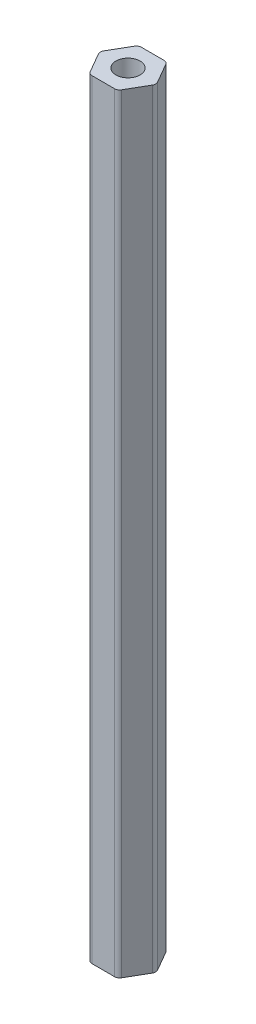
ISO-10303-21;
HEADER;
FILE_DESCRIPTION(('STEP AP214'),'2;1');
FILE_NAME('part.step','',(''),(''),'','','');
FILE_SCHEMA(('AUTOMOTIVE_DESIGN { 1 0 10303 214 1 1 1 1 }'));
ENDSEC;
DATA;
#1=APPLICATION_CONTEXT('core data for automotive mechanical design processes');
#2=APPLICATION_PROTOCOL_DEFINITION('international standard','automotive_design',2000,#1);
#3=PRODUCT_CONTEXT('',#1,'mechanical');
#4=PRODUCT('Part','Part','',(#3));
#5=PRODUCT_RELATED_PRODUCT_CATEGORY('part','',(#4));
#6=PRODUCT_DEFINITION_FORMATION('','',#4);
#7=PRODUCT_DEFINITION_CONTEXT('part definition',#1,'design');
#8=PRODUCT_DEFINITION('design','',#6,#7);
#9=PRODUCT_DEFINITION_SHAPE('','',#8);
#10=(LENGTH_UNIT() NAMED_UNIT(*) SI_UNIT(.MILLI.,.METRE.));
#11=(NAMED_UNIT(*) PLANE_ANGLE_UNIT() SI_UNIT($,.RADIAN.));
#12=(NAMED_UNIT(*) SI_UNIT($,.STERADIAN.) SOLID_ANGLE_UNIT());
#13=UNCERTAINTY_MEASURE_WITH_UNIT(LENGTH_MEASURE(1.E-05),#10,'distance_accuracy_value','');
#14=(GEOMETRIC_REPRESENTATION_CONTEXT(3) GLOBAL_UNCERTAINTY_ASSIGNED_CONTEXT((#13)) GLOBAL_UNIT_ASSIGNED_CONTEXT((#10,
#11,#12)) REPRESENTATION_CONTEXT('',''));
#15=CARTESIAN_POINT('',(0.,0.,0.));
#16=DIRECTION('',(0.,0.,1.));
#17=DIRECTION('',(1.,0.,0.));
#18=AXIS2_PLACEMENT_3D('',#15,#16,#17);
#19=CARTESIAN_POINT('',(-2.88675134594813,80.,0.));
#20=DIRECTION('',(0.866025403784439,0.,-0.5));
#21=DIRECTION('',(0.,-1.,0.));
#22=AXIS2_PLACEMENT_3D('',#19,#20,#21);
#23=PLANE('',#22);
#24=DIRECTION('',(0.5,0.,0.866025403784439));
#25=VECTOR('',#24,1.);
#26=CARTESIAN_POINT('',(-2.88675134594813,0.,0.));
#27=LINE('',#26,#25);
#28=CARTESIAN_POINT('',(-2.74241377865073,0.,0.25));
#29=VERTEX_POINT('',#28);
#30=CARTESIAN_POINT('',(-1.58771324027147,0.,2.25));
#31=VERTEX_POINT('',#30);
#32=EDGE_CURVE('E12',#29,#31,#27,.T.);
#33=ORIENTED_EDGE('',*,*,#32,.T.);
#34=DIRECTION('',(0.,1.,0.));
#35=VECTOR('',#34,1.);
#36=CARTESIAN_POINT('',(-1.58771324027147,80.,2.25));
#37=LINE('',#36,#35);
#38=CARTESIAN_POINT('',(-1.58771324027147,78.,2.25));
#39=VERTEX_POINT('',#38);
#40=EDGE_CURVE('E50',#31,#39,#37,.T.);
#41=ORIENTED_EDGE('',*,*,#40,.T.);
#42=DIRECTION('',(0.5,0.,0.866025403784439));
#43=VECTOR('',#42,1.);
#44=CARTESIAN_POINT('',(-2.88675134594813,78.,0.));
#45=LINE('',#44,#43);
#46=CARTESIAN_POINT('',(-2.74241377865073,78.,0.25));
#47=VERTEX_POINT('',#46);
#48=EDGE_CURVE('E193',#47,#39,#45,.T.);
#49=ORIENTED_EDGE('',*,*,#48,.F.);
#50=DIRECTION('',(0.,-1.,0.));
#51=VECTOR('',#50,1.);
#52=CARTESIAN_POINT('',(-2.74241377865073,80.,0.25));
#53=LINE('',#52,#51);
#54=EDGE_CURVE('E224',#47,#29,#53,.T.);
#55=ORIENTED_EDGE('',*,*,#54,.T.);
#56=EDGE_LOOP('',(#33,#41,#49,#55));
#57=FACE_BOUND('',#56,.T.);
#58=ADVANCED_FACE('F39',(#57),#23,.F.);
#59=CARTESIAN_POINT('',(-1.44337567297407,80.,2.5));
#60=DIRECTION('',(0.,0.,-1.));
#61=DIRECTION('',(0.,-1.,0.));
#62=AXIS2_PLACEMENT_3D('',#59,#60,#61);
#63=PLANE('',#62);
#64=DIRECTION('',(1.,0.,0.));
#65=VECTOR('',#64,1.);
#66=CARTESIAN_POINT('',(-1.44337567297407,78.,2.5));
#67=LINE('',#66,#65);
#68=CARTESIAN_POINT('',(-1.15470053837925,78.,2.5));
#69=VERTEX_POINT('',#68);
#70=CARTESIAN_POINT('',(1.15470053837925,78.,2.5));
#71=VERTEX_POINT('',#70);
#72=EDGE_CURVE('E111',#69,#71,#67,.T.);
#73=ORIENTED_EDGE('',*,*,#72,.F.);
#74=DIRECTION('',(0.,-1.,0.));
#75=VECTOR('',#74,1.);
#76=CARTESIAN_POINT('',(-1.15470053837925,80.,2.5));
#77=LINE('',#76,#75);
#78=CARTESIAN_POINT('',(-1.15470053837925,0.,2.5));
#79=VERTEX_POINT('',#78);
#80=EDGE_CURVE('E222',#69,#79,#77,.T.);
#81=ORIENTED_EDGE('',*,*,#80,.T.);
#82=DIRECTION('',(1.,0.,0.));
#83=VECTOR('',#82,1.);
#84=CARTESIAN_POINT('',(-1.44337567297407,0.,2.5));
#85=LINE('',#84,#83);
#86=CARTESIAN_POINT('',(1.15470053837925,0.,2.5));
#87=VERTEX_POINT('',#86);
#88=EDGE_CURVE('E120',#79,#87,#85,.T.);
#89=ORIENTED_EDGE('',*,*,#88,.T.);
#90=DIRECTION('',(0.,1.,0.));
#91=VECTOR('',#90,1.);
#92=CARTESIAN_POINT('',(1.15470053837925,80.,2.5));
#93=LINE('',#92,#91);
#94=EDGE_CURVE('E177',#87,#71,#93,.T.);
#95=ORIENTED_EDGE('',*,*,#94,.T.);
#96=EDGE_LOOP('',(#73,#81,#89,#95));
#97=FACE_BOUND('',#96,.T.);
#98=ADVANCED_FACE('F285',(#97),#63,.F.);
#99=CARTESIAN_POINT('',(1.44337567297407,80.,2.5));
#100=DIRECTION('',(-0.866025403784439,0.,-0.5));
#101=DIRECTION('',(-0.5,0.,0.866025403784439));
#102=AXIS2_PLACEMENT_3D('',#99,#100,#101);
#103=PLANE('',#102);
#104=DIRECTION('',(0.5,0.,-0.866025403784439));
#105=VECTOR('',#104,1.);
#106=CARTESIAN_POINT('',(1.44337567297407,0.,2.5));
#107=LINE('',#106,#105);
#108=CARTESIAN_POINT('',(1.58771324027147,0.,2.25));
#109=VERTEX_POINT('',#108);
#110=CARTESIAN_POINT('',(2.74241377865073,0.,0.25));
#111=VERTEX_POINT('',#110);
#112=EDGE_CURVE('E187',#109,#111,#107,.T.);
#113=ORIENTED_EDGE('',*,*,#112,.T.);
#114=DIRECTION('',(0.,1.,0.));
#115=VECTOR('',#114,1.);
#116=CARTESIAN_POINT('',(2.74241377865073,80.,0.25));
#117=LINE('',#116,#115);
#118=CARTESIAN_POINT('',(2.74241377865073,78.,0.25));
#119=VERTEX_POINT('',#118);
#120=EDGE_CURVE('E184',#111,#119,#117,.T.);
#121=ORIENTED_EDGE('',*,*,#120,.T.);
#122=DIRECTION('',(0.5,0.,-0.866025403784439));
#123=VECTOR('',#122,1.);
#124=CARTESIAN_POINT('',(1.44337567297407,78.,2.5));
#125=LINE('',#124,#123);
#126=CARTESIAN_POINT('',(1.58771324027147,78.,2.25));
#127=VERTEX_POINT('',#126);
#128=EDGE_CURVE('E215',#127,#119,#125,.T.);
#129=ORIENTED_EDGE('',*,*,#128,.F.);
#130=DIRECTION('',(0.,-1.,0.));
#131=VECTOR('',#130,1.);
#132=CARTESIAN_POINT('',(1.58771324027147,80.,2.25));
#133=LINE('',#132,#131);
#134=EDGE_CURVE('E182',#127,#109,#133,.T.);
#135=ORIENTED_EDGE('',*,*,#134,.T.);
#136=EDGE_LOOP('',(#113,#121,#129,#135));
#137=FACE_BOUND('',#136,.T.);
#138=ADVANCED_FACE('F287',(#137),#103,.F.);
#139=CARTESIAN_POINT('',(2.88675134594813,80.,0.));
#140=DIRECTION('',(-0.866025403784438,0.,0.5));
#141=DIRECTION('',(0.,1.,0.));
#142=AXIS2_PLACEMENT_3D('',#139,#140,#141);
#143=PLANE('',#142);
#144=DIRECTION('',(-0.5,0.,-0.866025403784438));
#145=VECTOR('',#144,1.);
#146=CARTESIAN_POINT('',(2.88675134594813,78.,0.));
#147=LINE('',#146,#145);
#148=CARTESIAN_POINT('',(2.74241377865073,78.,-0.25));
#149=VERTEX_POINT('',#148);
#150=CARTESIAN_POINT('',(1.58771324027147,78.,-2.25));
#151=VERTEX_POINT('',#150);
#152=EDGE_CURVE('E210',#149,#151,#147,.T.);
#153=ORIENTED_EDGE('',*,*,#152,.F.);
#154=DIRECTION('',(0.,-1.,0.));
#155=VECTOR('',#154,1.);
#156=CARTESIAN_POINT('',(2.74241377865073,80.,-0.25));
#157=LINE('',#156,#155);
#158=CARTESIAN_POINT('',(2.74241377865073,0.,-0.25));
#159=VERTEX_POINT('',#158);
#160=EDGE_CURVE('E178',#149,#159,#157,.T.);
#161=ORIENTED_EDGE('',*,*,#160,.T.);
#162=DIRECTION('',(-0.5,0.,-0.866025403784438));
#163=VECTOR('',#162,1.);
#164=CARTESIAN_POINT('',(2.88675134594813,0.,0.));
#165=LINE('',#164,#163);
#166=CARTESIAN_POINT('',(1.58771324027147,0.,-2.25));
#167=VERTEX_POINT('',#166);
#168=EDGE_CURVE('E183',#159,#167,#165,.T.);
#169=ORIENTED_EDGE('',*,*,#168,.T.);
#170=DIRECTION('',(0.,1.,0.));
#171=VECTOR('',#170,1.);
#172=CARTESIAN_POINT('',(1.58771324027147,80.,-2.25));
#173=LINE('',#172,#171);
#174=EDGE_CURVE('E249',#167,#151,#173,.T.);
#175=ORIENTED_EDGE('',*,*,#174,.T.);
#176=EDGE_LOOP('',(#153,#161,#169,#175));
#177=FACE_BOUND('',#176,.T.);
#178=ADVANCED_FACE('F268',(#177),#143,.F.);
#179=CARTESIAN_POINT('',(1.44337567297407,80.,-2.5));
#180=DIRECTION('',(0.,0.,1.));
#181=DIRECTION('',(1.,0.,0.));
#182=AXIS2_PLACEMENT_3D('',#179,#180,#181);
#183=PLANE('',#182);
#184=DIRECTION('',(-1.,0.,0.));
#185=VECTOR('',#184,1.);
#186=CARTESIAN_POINT('',(1.44337567297407,78.,-2.5));
#187=LINE('',#186,#185);
#188=CARTESIAN_POINT('',(1.15470053837926,78.,-2.5));
#189=VERTEX_POINT('',#188);
#190=CARTESIAN_POINT('',(-1.15470053837925,78.,-2.5));
#191=VERTEX_POINT('',#190);
#192=EDGE_CURVE('E205',#189,#191,#187,.T.);
#193=ORIENTED_EDGE('',*,*,#192,.F.);
#194=DIRECTION('',(0.,-1.,0.));
#195=VECTOR('',#194,1.);
#196=CARTESIAN_POINT('',(1.15470053837926,80.,-2.5));
#197=LINE('',#196,#195);
#198=CARTESIAN_POINT('',(1.15470053837926,0.,-2.5));
#199=VERTEX_POINT('',#198);
#200=EDGE_CURVE('E159',#189,#199,#197,.T.);
#201=ORIENTED_EDGE('',*,*,#200,.T.);
#202=DIRECTION('',(-1.,0.,0.));
#203=VECTOR('',#202,1.);
#204=CARTESIAN_POINT('',(1.44337567297407,0.,-2.5));
#205=LINE('',#204,#203);
#206=CARTESIAN_POINT('',(-1.15470053837925,0.,-2.5));
#207=VERTEX_POINT('',#206);
#208=EDGE_CURVE('E153',#199,#207,#205,.T.);
#209=ORIENTED_EDGE('',*,*,#208,.T.);
#210=DIRECTION('',(0.,1.,0.));
#211=VECTOR('',#210,1.);
#212=CARTESIAN_POINT('',(-1.15470053837925,80.,-2.5));
#213=LINE('',#212,#211);
#214=EDGE_CURVE('E143',#207,#191,#213,.T.);
#215=ORIENTED_EDGE('',*,*,#214,.T.);
#216=EDGE_LOOP('',(#193,#201,#209,#215));
#217=FACE_BOUND('',#216,.T.);
#218=ADVANCED_FACE('F157',(#217),#183,.F.);
#219=CARTESIAN_POINT('',(-1.44337567297407,80.,-2.5));
#220=DIRECTION('',(0.866025403784438,0.,0.5));
#221=DIRECTION('',(0.,-1.,0.));
#222=AXIS2_PLACEMENT_3D('',#219,#220,#221);
#223=PLANE('',#222);
#224=DIRECTION('',(-0.5,0.,0.866025403784438));
#225=VECTOR('',#224,1.);
#226=CARTESIAN_POINT('',(-1.44337567297407,78.,-2.5));
#227=LINE('',#226,#225);
#228=CARTESIAN_POINT('',(-1.58771324027147,78.,-2.25));
#229=VERTEX_POINT('',#228);
#230=CARTESIAN_POINT('',(-2.74241377865073,78.,-0.25));
#231=VERTEX_POINT('',#230);
#232=EDGE_CURVE('E200',#229,#231,#227,.T.);
#233=ORIENTED_EDGE('',*,*,#232,.F.);
#234=DIRECTION('',(0.,-1.,0.));
#235=VECTOR('',#234,1.);
#236=CARTESIAN_POINT('',(-1.58771324027147,80.,-2.25));
#237=LINE('',#236,#235);
#238=CARTESIAN_POINT('',(-1.58771324027147,0.,-2.25));
#239=VERTEX_POINT('',#238);
#240=EDGE_CURVE('E154',#229,#239,#237,.T.);
#241=ORIENTED_EDGE('',*,*,#240,.T.);
#242=DIRECTION('',(-0.5,0.,0.866025403784438));
#243=VECTOR('',#242,1.);
#244=CARTESIAN_POINT('',(-1.44337567297407,0.,-2.5));
#245=LINE('',#244,#243);
#246=CARTESIAN_POINT('',(-2.74241377865073,0.,-0.25));
#247=VERTEX_POINT('',#246);
#248=EDGE_CURVE('E166',#239,#247,#245,.T.);
#249=ORIENTED_EDGE('',*,*,#248,.T.);
#250=DIRECTION('',(0.,1.,0.));
#251=VECTOR('',#250,1.);
#252=CARTESIAN_POINT('',(-2.74241377865073,80.,-0.25));
#253=LINE('',#252,#251);
#254=EDGE_CURVE('E196',#247,#231,#253,.T.);
#255=ORIENTED_EDGE('',*,*,#254,.T.);
#256=EDGE_LOOP('',(#233,#241,#249,#255));
#257=FACE_BOUND('',#256,.T.);
#258=ADVANCED_FACE('F312',(#257),#223,.F.);
#259=CARTESIAN_POINT('',(0.,78.,0.));
#260=DIRECTION('',(0.,1.,0.));
#261=DIRECTION('',(1.,0.,0.));
#262=AXIS2_PLACEMENT_3D('',#259,#260,#261);
#263=PLANE('',#262);
#264=CARTESIAN_POINT('',(0.,78.,0.));
#265=DIRECTION('',(0.,1.,0.));
#266=DIRECTION('',(0.,0.,1.));
#267=AXIS2_PLACEMENT_3D('',#264,#265,#266);
#268=CIRCLE('',#267,1.2295);
#269=CARTESIAN_POINT('',(0.,78.,1.2295));
#270=VERTEX_POINT('',#269);
#271=EDGE_CURVE('E189',#270,#270,#268,.T.);
#272=ORIENTED_EDGE('',*,*,#271,.F.);
#273=EDGE_LOOP('',(#272));
#274=FACE_BOUND('',#273,.T.);
#275=ORIENTED_EDGE('',*,*,#48,.T.);
#276=CARTESIAN_POINT('',(-1.15470053837925,78.,2.));
#277=DIRECTION('',(0.,1.,0.));
#278=DIRECTION('',(0.,0.,1.));
#279=AXIS2_PLACEMENT_3D('',#276,#277,#278);
#280=CIRCLE('',#279,0.5);
#281=EDGE_CURVE('E43',#39,#69,#280,.T.);
#282=ORIENTED_EDGE('',*,*,#281,.T.);
#283=ORIENTED_EDGE('',*,*,#72,.T.);
#284=CARTESIAN_POINT('',(1.15470053837925,78.,2.));
#285=DIRECTION('',(0.,1.,0.));
#286=DIRECTION('',(0.,0.,1.));
#287=AXIS2_PLACEMENT_3D('',#284,#285,#286);
#288=CIRCLE('',#287,0.5);
#289=EDGE_CURVE('E217',#71,#127,#288,.T.);
#290=ORIENTED_EDGE('',*,*,#289,.T.);
#291=ORIENTED_EDGE('',*,*,#128,.T.);
#292=CARTESIAN_POINT('',(2.30940107675851,78.,0.));
#293=DIRECTION('',(0.,1.,0.));
#294=DIRECTION('',(0.,0.,1.));
#295=AXIS2_PLACEMENT_3D('',#292,#293,#294);
#296=CIRCLE('',#295,0.5);
#297=EDGE_CURVE('E212',#119,#149,#296,.T.);
#298=ORIENTED_EDGE('',*,*,#297,.T.);
#299=ORIENTED_EDGE('',*,*,#152,.T.);
#300=CARTESIAN_POINT('',(1.15470053837926,78.,-2.));
#301=DIRECTION('',(0.,1.,0.));
#302=DIRECTION('',(0.,0.,1.));
#303=AXIS2_PLACEMENT_3D('',#300,#301,#302);
#304=CIRCLE('',#303,0.5);
#305=EDGE_CURVE('E207',#151,#189,#304,.T.);
#306=ORIENTED_EDGE('',*,*,#305,.T.);
#307=ORIENTED_EDGE('',*,*,#192,.T.);
#308=CARTESIAN_POINT('',(-1.15470053837925,78.,-2.));
#309=DIRECTION('',(0.,1.,0.));
#310=DIRECTION('',(0.,0.,1.));
#311=AXIS2_PLACEMENT_3D('',#308,#309,#310);
#312=CIRCLE('',#311,0.5);
#313=EDGE_CURVE('E150',#191,#229,#312,.T.);
#314=ORIENTED_EDGE('',*,*,#313,.T.);
#315=ORIENTED_EDGE('',*,*,#232,.T.);
#316=CARTESIAN_POINT('',(-2.30940107675851,78.,0.));
#317=DIRECTION('',(0.,1.,0.));
#318=DIRECTION('',(0.,0.,1.));
#319=AXIS2_PLACEMENT_3D('',#316,#317,#318);
#320=CIRCLE('',#319,0.5);
#321=EDGE_CURVE('E197',#231,#47,#320,.T.);
#322=ORIENTED_EDGE('',*,*,#321,.T.);
#323=EDGE_LOOP('',(#275,#282,#283,#290,#291,#298,#299,#306,#307,#314,#315,#322));
#324=FACE_BOUND('',#323,.T.);
#325=ADVANCED_FACE('F41',(#274,#324),#263,.T.);
#326=CARTESIAN_POINT('',(0.,0.,0.));
#327=DIRECTION('',(0.,1.,0.));
#328=DIRECTION('',(1.,0.,0.));
#329=AXIS2_PLACEMENT_3D('',#326,#327,#328);
#330=PLANE('',#329);
#331=CARTESIAN_POINT('',(0.,0.,0.));
#332=DIRECTION('',(0.,1.,0.));
#333=DIRECTION('',(0.,0.,-1.));
#334=AXIS2_PLACEMENT_3D('',#331,#332,#333);
#335=CIRCLE('',#334,1.2295);
#336=CARTESIAN_POINT('',(0.,0.,-1.2295));
#337=VERTEX_POINT('',#336);
#338=EDGE_CURVE('E201',#337,#337,#335,.T.);
#339=ORIENTED_EDGE('',*,*,#338,.T.);
#340=EDGE_LOOP('',(#339));
#341=FACE_BOUND('',#340,.T.);
#342=ORIENTED_EDGE('',*,*,#88,.F.);
#343=CARTESIAN_POINT('',(-1.15470053837925,0.,2.));
#344=DIRECTION('',(0.,-1.,0.));
#345=DIRECTION('',(0.,0.,1.));
#346=AXIS2_PLACEMENT_3D('',#343,#344,#345);
#347=CIRCLE('',#346,0.5);
#348=EDGE_CURVE('E171',#79,#31,#347,.T.);
#349=ORIENTED_EDGE('',*,*,#348,.T.);
#350=ORIENTED_EDGE('',*,*,#32,.F.);
#351=CARTESIAN_POINT('',(-2.30940107675851,0.,0.));
#352=DIRECTION('',(0.,-1.,0.));
#353=DIRECTION('',(0.,0.,1.));
#354=AXIS2_PLACEMENT_3D('',#351,#352,#353);
#355=CIRCLE('',#354,0.5);
#356=EDGE_CURVE('E168',#29,#247,#355,.T.);
#357=ORIENTED_EDGE('',*,*,#356,.T.);
#358=ORIENTED_EDGE('',*,*,#248,.F.);
#359=CARTESIAN_POINT('',(-1.15470053837925,0.,-2.));
#360=DIRECTION('',(0.,-1.,0.));
#361=DIRECTION('',(0.,0.,1.));
#362=AXIS2_PLACEMENT_3D('',#359,#360,#361);
#363=CIRCLE('',#362,0.5);
#364=EDGE_CURVE('E148',#239,#207,#363,.T.);
#365=ORIENTED_EDGE('',*,*,#364,.T.);
#366=ORIENTED_EDGE('',*,*,#208,.F.);
#367=CARTESIAN_POINT('',(1.15470053837926,0.,-2.));
#368=DIRECTION('',(0.,-1.,0.));
#369=DIRECTION('',(0.,0.,1.));
#370=AXIS2_PLACEMENT_3D('',#367,#368,#369);
#371=CIRCLE('',#370,0.5);
#372=EDGE_CURVE('E169',#199,#167,#371,.T.);
#373=ORIENTED_EDGE('',*,*,#372,.T.);
#374=ORIENTED_EDGE('',*,*,#168,.F.);
#375=CARTESIAN_POINT('',(2.30940107675851,0.,0.));
#376=DIRECTION('',(0.,-1.,0.));
#377=DIRECTION('',(0.,0.,1.));
#378=AXIS2_PLACEMENT_3D('',#375,#376,#377);
#379=CIRCLE('',#378,0.5);
#380=EDGE_CURVE('E173',#159,#111,#379,.T.);
#381=ORIENTED_EDGE('',*,*,#380,.T.);
#382=ORIENTED_EDGE('',*,*,#112,.F.);
#383=CARTESIAN_POINT('',(1.15470053837925,0.,2.));
#384=DIRECTION('',(0.,-1.,0.));
#385=DIRECTION('',(0.,0.,1.));
#386=AXIS2_PLACEMENT_3D('',#383,#384,#385);
#387=CIRCLE('',#386,0.5);
#388=EDGE_CURVE('E192',#109,#87,#387,.T.);
#389=ORIENTED_EDGE('',*,*,#388,.T.);
#390=EDGE_LOOP('',(#342,#349,#350,#357,#358,#365,#366,#373,#374,#381,#382,#389));
#391=FACE_BOUND('',#390,.T.);
#392=ADVANCED_FACE('F163',(#341,#391),#330,.F.);
#393=CARTESIAN_POINT('',(0.,0.,0.));
#394=DIRECTION('',(0.,1.,0.));
#395=DIRECTION('',(0.,0.,-1.));
#396=AXIS2_PLACEMENT_3D('',#393,#394,#395);
#397=CYLINDRICAL_SURFACE('',#396,1.2295);
#398=ORIENTED_EDGE('',*,*,#271,.T.);
#399=EDGE_LOOP('',(#398));
#400=FACE_BOUND('',#399,.T.);
#401=ORIENTED_EDGE('',*,*,#338,.F.);
#402=EDGE_LOOP('',(#401));
#403=FACE_BOUND('',#402,.T.);
#404=ADVANCED_FACE('F299',(#400,#403),#397,.F.);
#405=CARTESIAN_POINT('',(1.15470053837925,80.,2.));
#406=DIRECTION('',(0.,-1.,0.));
#407=DIRECTION('',(0.,0.,-1.));
#408=AXIS2_PLACEMENT_3D('',#405,#406,#407);
#409=CYLINDRICAL_SURFACE('',#408,0.5);
#410=ORIENTED_EDGE('',*,*,#289,.F.);
#411=ORIENTED_EDGE('',*,*,#94,.F.);
#412=ORIENTED_EDGE('',*,*,#388,.F.);
#413=ORIENTED_EDGE('',*,*,#134,.F.);
#414=EDGE_LOOP('',(#410,#411,#412,#413));
#415=FACE_BOUND('',#414,.T.);
#416=ADVANCED_FACE('F283',(#415),#409,.T.);
#417=CARTESIAN_POINT('',(-2.30940107675851,80.,0.));
#418=DIRECTION('',(0.,-1.,0.));
#419=DIRECTION('',(0.,0.,-1.));
#420=AXIS2_PLACEMENT_3D('',#417,#418,#419);
#421=CYLINDRICAL_SURFACE('',#420,0.5);
#422=ORIENTED_EDGE('',*,*,#321,.F.);
#423=ORIENTED_EDGE('',*,*,#254,.F.);
#424=ORIENTED_EDGE('',*,*,#356,.F.);
#425=ORIENTED_EDGE('',*,*,#54,.F.);
#426=EDGE_LOOP('',(#422,#423,#424,#425));
#427=FACE_BOUND('',#426,.T.);
#428=ADVANCED_FACE('F298',(#427),#421,.T.);
#429=CARTESIAN_POINT('',(-1.15470053837925,80.,-2.));
#430=DIRECTION('',(0.,-1.,0.));
#431=DIRECTION('',(0.,0.,-1.));
#432=AXIS2_PLACEMENT_3D('',#429,#430,#431);
#433=CYLINDRICAL_SURFACE('',#432,0.5);
#434=ORIENTED_EDGE('',*,*,#313,.F.);
#435=ORIENTED_EDGE('',*,*,#214,.F.);
#436=ORIENTED_EDGE('',*,*,#364,.F.);
#437=ORIENTED_EDGE('',*,*,#240,.F.);
#438=EDGE_LOOP('',(#434,#435,#436,#437));
#439=FACE_BOUND('',#438,.T.);
#440=ADVANCED_FACE('F145',(#439),#433,.T.);
#441=CARTESIAN_POINT('',(1.15470053837926,80.,-2.));
#442=DIRECTION('',(0.,-1.,0.));
#443=DIRECTION('',(0.,0.,-1.));
#444=AXIS2_PLACEMENT_3D('',#441,#442,#443);
#445=CYLINDRICAL_SURFACE('',#444,0.5);
#446=ORIENTED_EDGE('',*,*,#305,.F.);
#447=ORIENTED_EDGE('',*,*,#174,.F.);
#448=ORIENTED_EDGE('',*,*,#372,.F.);
#449=ORIENTED_EDGE('',*,*,#200,.F.);
#450=EDGE_LOOP('',(#446,#447,#448,#449));
#451=FACE_BOUND('',#450,.T.);
#452=ADVANCED_FACE('F273',(#451),#445,.T.);
#453=CARTESIAN_POINT('',(2.30940107675851,80.,0.));
#454=DIRECTION('',(0.,-1.,0.));
#455=DIRECTION('',(0.,0.,-1.));
#456=AXIS2_PLACEMENT_3D('',#453,#454,#455);
#457=CYLINDRICAL_SURFACE('',#456,0.5);
#458=ORIENTED_EDGE('',*,*,#297,.F.);
#459=ORIENTED_EDGE('',*,*,#120,.F.);
#460=ORIENTED_EDGE('',*,*,#380,.F.);
#461=ORIENTED_EDGE('',*,*,#160,.F.);
#462=EDGE_LOOP('',(#458,#459,#460,#461));
#463=FACE_BOUND('',#462,.T.);
#464=ADVANCED_FACE('F276',(#463),#457,.T.);
#465=CARTESIAN_POINT('',(-1.15470053837925,80.,2.));
#466=DIRECTION('',(0.,-1.,0.));
#467=DIRECTION('',(0.,0.,-1.));
#468=AXIS2_PLACEMENT_3D('',#465,#466,#467);
#469=CYLINDRICAL_SURFACE('',#468,0.5);
#470=ORIENTED_EDGE('',*,*,#281,.F.);
#471=ORIENTED_EDGE('',*,*,#40,.F.);
#472=ORIENTED_EDGE('',*,*,#348,.F.);
#473=ORIENTED_EDGE('',*,*,#80,.F.);
#474=EDGE_LOOP('',(#470,#471,#472,#473));
#475=FACE_BOUND('',#474,.T.);
#476=ADVANCED_FACE('F221',(#475),#469,.T.);
#477=CLOSED_SHELL('',(#58,#98,#138,#178,#218,#258,#325,#392,#404,#416,#428,#440,#452,#464,#476));
#478=MANIFOLD_SOLID_BREP('B2',#477);
#479=ADVANCED_BREP_SHAPE_REPRESENTATION('',(#18,#478),#14);
#480=SHAPE_DEFINITION_REPRESENTATION(#9,#479);
ENDSEC;
END-ISO-10303-21;
